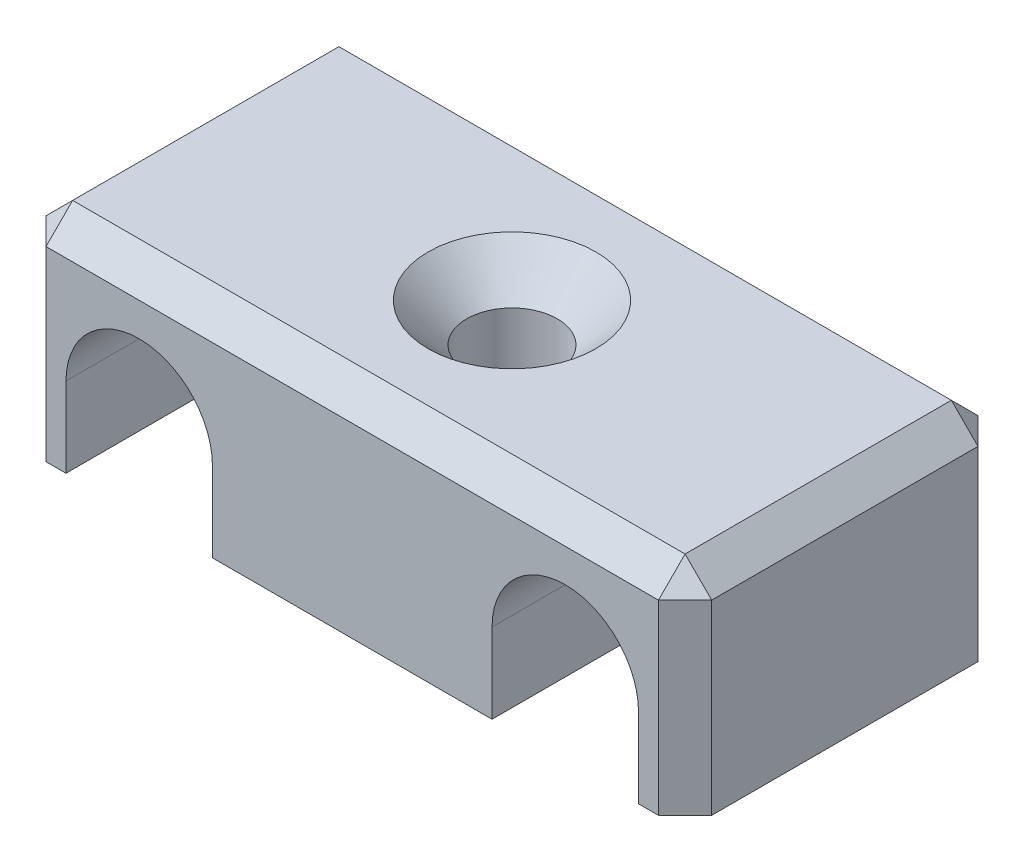
ISO-10303-21;
HEADER;
FILE_DESCRIPTION(('STEP AP214'),'2;1');
FILE_NAME('part.step','',(''),(''),'','','');
FILE_SCHEMA(('AUTOMOTIVE_DESIGN { 1 0 10303 214 1 1 1 1 }'));
ENDSEC;
DATA;
#1=APPLICATION_CONTEXT('core data for automotive mechanical design processes');
#2=APPLICATION_PROTOCOL_DEFINITION('international standard','automotive_design',2000,#1);
#3=PRODUCT_CONTEXT('',#1,'mechanical');
#4=PRODUCT('Part','Part','',(#3));
#5=PRODUCT_RELATED_PRODUCT_CATEGORY('part','',(#4));
#6=PRODUCT_DEFINITION_FORMATION('','',#4);
#7=PRODUCT_DEFINITION_CONTEXT('part definition',#1,'design');
#8=PRODUCT_DEFINITION('design','',#6,#7);
#9=PRODUCT_DEFINITION_SHAPE('','',#8);
#10=(LENGTH_UNIT() NAMED_UNIT(*) SI_UNIT(.MILLI.,.METRE.));
#11=(NAMED_UNIT(*) PLANE_ANGLE_UNIT() SI_UNIT($,.RADIAN.));
#12=(NAMED_UNIT(*) SI_UNIT($,.STERADIAN.) SOLID_ANGLE_UNIT());
#13=UNCERTAINTY_MEASURE_WITH_UNIT(LENGTH_MEASURE(1.E-05),#10,'distance_accuracy_value','');
#14=(GEOMETRIC_REPRESENTATION_CONTEXT(3) GLOBAL_UNCERTAINTY_ASSIGNED_CONTEXT((#13)) GLOBAL_UNIT_ASSIGNED_CONTEXT((#10,
#11,#12)) REPRESENTATION_CONTEXT('',''));
#15=CARTESIAN_POINT('',(0.,0.,0.));
#16=DIRECTION('',(0.,0.,1.));
#17=DIRECTION('',(1.,0.,0.));
#18=AXIS2_PLACEMENT_3D('',#15,#16,#17);
#19=CARTESIAN_POINT('',(-12.5,-4.,12.));
#20=DIRECTION('',(0.,1.,0.));
#21=DIRECTION('',(0.,0.,1.));
#22=AXIS2_PLACEMENT_3D('',#19,#20,#21);
#23=PLANE('',#22);
#24=DIRECTION('',(1.,0.,0.));
#25=VECTOR('',#24,1.);
#26=CARTESIAN_POINT('',(-12.5,-4.,0.));
#27=LINE('',#26,#25);
#28=CARTESIAN_POINT('',(10.75,-4.,0.));
#29=VERTEX_POINT('',#28);
#30=CARTESIAN_POINT('',(11.5,-4.,0.));
#31=VERTEX_POINT('',#30);
#32=EDGE_CURVE('E238',#29,#31,#27,.T.);
#33=ORIENTED_EDGE('',*,*,#32,.T.);
#34=DIRECTION('',(0.70710678118655,0.,0.707106781186545));
#35=VECTOR('',#34,1.);
#36=CARTESIAN_POINT('',(12.5,-4.,0.999999999999997));
#37=LINE('',#36,#35);
#38=CARTESIAN_POINT('',(12.5,-4.,0.999999999999997));
#39=VERTEX_POINT('',#38);
#40=EDGE_CURVE('E286',#31,#39,#37,.T.);
#41=ORIENTED_EDGE('',*,*,#40,.T.);
#42=DIRECTION('',(0.,0.,-1.));
#43=VECTOR('',#42,1.);
#44=CARTESIAN_POINT('',(12.5,-4.,12.));
#45=LINE('',#44,#43);
#46=CARTESIAN_POINT('',(12.5,-4.,11.));
#47=VERTEX_POINT('',#46);
#48=EDGE_CURVE('E241',#47,#39,#45,.T.);
#49=ORIENTED_EDGE('',*,*,#48,.F.);
#50=DIRECTION('',(0.707106781186545,0.,-0.70710678118655));
#51=VECTOR('',#50,1.);
#52=CARTESIAN_POINT('',(11.5,-4.,12.));
#53=LINE('',#52,#51);
#54=CARTESIAN_POINT('',(11.5,-4.,12.));
#55=VERTEX_POINT('',#54);
#56=EDGE_CURVE('E284',#47,#55,#53,.F.);
#57=ORIENTED_EDGE('',*,*,#56,.T.);
#58=DIRECTION('',(1.,0.,0.));
#59=VECTOR('',#58,1.);
#60=CARTESIAN_POINT('',(-12.5,-4.,12.));
#61=LINE('',#60,#59);
#62=CARTESIAN_POINT('',(10.75,-4.,12.));
#63=VERTEX_POINT('',#62);
#64=EDGE_CURVE('E243',#63,#55,#61,.T.);
#65=ORIENTED_EDGE('',*,*,#64,.F.);
#66=DIRECTION('',(0.,0.,1.));
#67=VECTOR('',#66,1.);
#68=CARTESIAN_POINT('',(10.75,-4.,0.));
#69=LINE('',#68,#67);
#70=EDGE_CURVE('E201',#29,#63,#69,.T.);
#71=ORIENTED_EDGE('',*,*,#70,.F.);
#72=EDGE_LOOP('',(#33,#41,#49,#57,#65,#71));
#73=FACE_BOUND('',#72,.T.);
#74=ADVANCED_FACE('F39',(#73),#23,.F.);
#75=CARTESIAN_POINT('',(0.,-4.,6.));
#76=DIRECTION('',(0.,1.,0.));
#77=DIRECTION('',(0.,0.,1.));
#78=AXIS2_PLACEMENT_3D('',#75,#76,#77);
#79=CIRCLE('',#78,1.7);
#80=CARTESIAN_POINT('',(0.,-4.,7.7));
#81=VERTEX_POINT('',#80);
#82=EDGE_CURVE('E235',#81,#81,#79,.T.);
#83=ORIENTED_EDGE('',*,*,#82,.T.);
#84=EDGE_LOOP('',(#83));
#85=FACE_BOUND('',#84,.T.);
#86=CARTESIAN_POINT('',(-5.25,-4.,0.));
#87=VERTEX_POINT('',#86);
#88=CARTESIAN_POINT('',(5.25,-4.,0.));
#89=VERTEX_POINT('',#88);
#90=EDGE_CURVE('E246',#87,#89,#27,.T.);
#91=ORIENTED_EDGE('',*,*,#90,.T.);
#92=DIRECTION('',(0.,0.,1.));
#93=VECTOR('',#92,1.);
#94=CARTESIAN_POINT('',(5.25,-4.,0.));
#95=LINE('',#94,#93);
#96=CARTESIAN_POINT('',(5.25,-4.,12.));
#97=VERTEX_POINT('',#96);
#98=EDGE_CURVE('E174',#89,#97,#95,.T.);
#99=ORIENTED_EDGE('',*,*,#98,.T.);
#100=CARTESIAN_POINT('',(-5.25,-4.,12.));
#101=VERTEX_POINT('',#100);
#102=EDGE_CURVE('E242',#101,#97,#61,.T.);
#103=ORIENTED_EDGE('',*,*,#102,.F.);
#104=DIRECTION('',(0.,0.,1.));
#105=VECTOR('',#104,1.);
#106=CARTESIAN_POINT('',(-5.25,-4.,0.));
#107=LINE('',#106,#105);
#108=EDGE_CURVE('E210',#87,#101,#107,.T.);
#109=ORIENTED_EDGE('',*,*,#108,.F.);
#110=EDGE_LOOP('',(#91,#99,#103,#109));
#111=FACE_BOUND('',#110,.T.);
#112=ADVANCED_FACE('F362',(#85,#111),#23,.F.);
#113=CARTESIAN_POINT('',(12.5,-4.,12.));
#114=DIRECTION('',(-1.,0.,0.));
#115=DIRECTION('',(0.,0.,1.));
#116=AXIS2_PLACEMENT_3D('',#113,#114,#115);
#117=PLANE('',#116);
#118=ORIENTED_EDGE('',*,*,#48,.T.);
#119=DIRECTION('',(0.,1.,0.));
#120=VECTOR('',#119,1.);
#121=CARTESIAN_POINT('',(12.5,4.,0.999999999999997));
#122=LINE('',#121,#120);
#123=CARTESIAN_POINT('',(12.5,3.,0.999999999999997));
#124=VERTEX_POINT('',#123);
#125=EDGE_CURVE('E282',#39,#124,#122,.T.);
#126=ORIENTED_EDGE('',*,*,#125,.T.);
#127=DIRECTION('',(0.,0.,1.));
#128=VECTOR('',#127,1.);
#129=CARTESIAN_POINT('',(12.5,3.,12.));
#130=LINE('',#129,#128);
#131=CARTESIAN_POINT('',(12.5,3.,11.));
#132=VERTEX_POINT('',#131);
#133=EDGE_CURVE('E280',#124,#132,#130,.T.);
#134=ORIENTED_EDGE('',*,*,#133,.T.);
#135=DIRECTION('',(0.,-1.,0.));
#136=VECTOR('',#135,1.);
#137=CARTESIAN_POINT('',(12.5,-4.,11.));
#138=LINE('',#137,#136);
#139=EDGE_CURVE('E278',#132,#47,#138,.T.);
#140=ORIENTED_EDGE('',*,*,#139,.T.);
#141=EDGE_LOOP('',(#118,#126,#134,#140));
#142=FACE_BOUND('',#141,.T.);
#143=ADVANCED_FACE('F372',(#142),#117,.F.);
#144=CARTESIAN_POINT('',(-12.5,4.,12.));
#145=DIRECTION('',(0.,-1.,0.));
#146=DIRECTION('',(0.,0.,-1.));
#147=AXIS2_PLACEMENT_3D('',#144,#145,#146);
#148=PLANE('',#147);
#149=DIRECTION('',(-1.,0.,0.));
#150=VECTOR('',#149,1.);
#151=CARTESIAN_POINT('',(-12.5,4.,0.999999999999997));
#152=LINE('',#151,#150);
#153=CARTESIAN_POINT('',(11.5,4.,0.999999999999997));
#154=VERTEX_POINT('',#153);
#155=CARTESIAN_POINT('',(-11.5,4.,0.999999999999997));
#156=VERTEX_POINT('',#155);
#157=EDGE_CURVE('E263',#154,#156,#152,.T.);
#158=ORIENTED_EDGE('',*,*,#157,.T.);
#159=DIRECTION('',(0.,0.,1.));
#160=VECTOR('',#159,1.);
#161=CARTESIAN_POINT('',(-11.5,4.,12.));
#162=LINE('',#161,#160);
#163=CARTESIAN_POINT('',(-11.5,4.,11.));
#164=VERTEX_POINT('',#163);
#165=EDGE_CURVE('E265',#156,#164,#162,.T.);
#166=ORIENTED_EDGE('',*,*,#165,.T.);
#167=DIRECTION('',(1.,0.,0.));
#168=VECTOR('',#167,1.);
#169=CARTESIAN_POINT('',(-12.5,4.,11.));
#170=LINE('',#169,#168);
#171=CARTESIAN_POINT('',(11.5,4.,11.));
#172=VERTEX_POINT('',#171);
#173=EDGE_CURVE('E259',#164,#172,#170,.T.);
#174=ORIENTED_EDGE('',*,*,#173,.T.);
#175=DIRECTION('',(0.,0.,-1.));
#176=VECTOR('',#175,1.);
#177=CARTESIAN_POINT('',(11.5,4.,12.));
#178=LINE('',#177,#176);
#179=EDGE_CURVE('E261',#172,#154,#178,.T.);
#180=ORIENTED_EDGE('',*,*,#179,.T.);
#181=EDGE_LOOP('',(#158,#166,#174,#180));
#182=FACE_BOUND('',#181,.T.);
#183=CARTESIAN_POINT('',(0.,4.,6.));
#184=DIRECTION('',(0.,1.,0.));
#185=DIRECTION('',(0.,0.,1.));
#186=AXIS2_PLACEMENT_3D('',#183,#184,#185);
#187=CIRCLE('',#186,3.15);
#188=CARTESIAN_POINT('',(0.,4.,9.15));
#189=VERTEX_POINT('',#188);
#190=EDGE_CURVE('E200',#189,#189,#187,.T.);
#191=ORIENTED_EDGE('',*,*,#190,.F.);
#192=EDGE_LOOP('',(#191));
#193=FACE_BOUND('',#192,.T.);
#194=ADVANCED_FACE('F392',(#182,#193),#148,.F.);
#195=CARTESIAN_POINT('',(-12.5,-4.,12.));
#196=DIRECTION('',(1.,0.,0.));
#197=DIRECTION('',(0.,0.,-1.));
#198=AXIS2_PLACEMENT_3D('',#195,#196,#197);
#199=PLANE('',#198);
#200=DIRECTION('',(0.,0.,-1.));
#201=VECTOR('',#200,1.);
#202=CARTESIAN_POINT('',(-12.5,3.,12.));
#203=LINE('',#202,#201);
#204=CARTESIAN_POINT('',(-12.5,3.,11.));
#205=VERTEX_POINT('',#204);
#206=CARTESIAN_POINT('',(-12.5,3.,1.));
#207=VERTEX_POINT('',#206);
#208=EDGE_CURVE('E254',#205,#207,#203,.T.);
#209=ORIENTED_EDGE('',*,*,#208,.T.);
#210=DIRECTION('',(0.,-1.,0.));
#211=VECTOR('',#210,1.);
#212=CARTESIAN_POINT('',(-12.5,-4.,1.));
#213=LINE('',#212,#211);
#214=CARTESIAN_POINT('',(-12.5,-4.,1.));
#215=VERTEX_POINT('',#214);
#216=EDGE_CURVE('E257',#207,#215,#213,.T.);
#217=ORIENTED_EDGE('',*,*,#216,.T.);
#218=DIRECTION('',(0.,0.,-1.));
#219=VECTOR('',#218,1.);
#220=CARTESIAN_POINT('',(-12.5,-4.,12.));
#221=LINE('',#220,#219);
#222=CARTESIAN_POINT('',(-12.5,-4.,11.));
#223=VERTEX_POINT('',#222);
#224=EDGE_CURVE('E249',#223,#215,#221,.T.);
#225=ORIENTED_EDGE('',*,*,#224,.F.);
#226=DIRECTION('',(0.,1.,0.));
#227=VECTOR('',#226,1.);
#228=CARTESIAN_POINT('',(-12.5,-4.,11.));
#229=LINE('',#228,#227);
#230=EDGE_CURVE('E252',#223,#205,#229,.T.);
#231=ORIENTED_EDGE('',*,*,#230,.T.);
#232=EDGE_LOOP('',(#209,#217,#225,#231));
#233=FACE_BOUND('',#232,.T.);
#234=ADVANCED_FACE('F405',(#233),#199,.F.);
#235=ORIENTED_EDGE('',*,*,#224,.T.);
#236=DIRECTION('',(0.707106781186545,0.,-0.70710678118655));
#237=VECTOR('',#236,1.);
#238=CARTESIAN_POINT('',(-12.5,-4.,1.));
#239=LINE('',#238,#237);
#240=CARTESIAN_POINT('',(-11.5,-4.,0.));
#241=VERTEX_POINT('',#240);
#242=EDGE_CURVE('E270',#215,#241,#239,.T.);
#243=ORIENTED_EDGE('',*,*,#242,.T.);
#244=CARTESIAN_POINT('',(-10.75,-4.,0.));
#245=VERTEX_POINT('',#244);
#246=EDGE_CURVE('E244',#241,#245,#27,.T.);
#247=ORIENTED_EDGE('',*,*,#246,.T.);
#248=DIRECTION('',(0.,0.,1.));
#249=VECTOR('',#248,1.);
#250=CARTESIAN_POINT('',(-10.75,-4.,0.));
#251=LINE('',#250,#249);
#252=CARTESIAN_POINT('',(-10.75,-4.,12.));
#253=VERTEX_POINT('',#252);
#254=EDGE_CURVE('E207',#245,#253,#251,.T.);
#255=ORIENTED_EDGE('',*,*,#254,.T.);
#256=CARTESIAN_POINT('',(-11.5,-4.,12.));
#257=VERTEX_POINT('',#256);
#258=EDGE_CURVE('E239',#257,#253,#61,.T.);
#259=ORIENTED_EDGE('',*,*,#258,.F.);
#260=DIRECTION('',(0.707106781186545,0.,0.70710678118655));
#261=VECTOR('',#260,1.);
#262=CARTESIAN_POINT('',(-11.5,-4.,12.));
#263=LINE('',#262,#261);
#264=EDGE_CURVE('E268',#257,#223,#263,.F.);
#265=ORIENTED_EDGE('',*,*,#264,.T.);
#266=EDGE_LOOP('',(#235,#243,#247,#255,#259,#265));
#267=FACE_BOUND('',#266,.T.);
#268=ADVANCED_FACE('F345',(#267),#23,.F.);
#269=CARTESIAN_POINT('',(0.,0.,12.));
#270=DIRECTION('',(0.,0.,-1.));
#271=DIRECTION('',(-1.,0.,0.));
#272=AXIS2_PLACEMENT_3D('',#269,#270,#271);
#273=PLANE('',#272);
#274=ORIENTED_EDGE('',*,*,#64,.T.);
#275=DIRECTION('',(0.,1.,0.));
#276=VECTOR('',#275,1.);
#277=CARTESIAN_POINT('',(11.5,0.,12.));
#278=LINE('',#277,#276);
#279=CARTESIAN_POINT('',(11.5,3.,12.));
#280=VERTEX_POINT('',#279);
#281=EDGE_CURVE('E11',#55,#280,#278,.T.);
#282=ORIENTED_EDGE('',*,*,#281,.T.);
#283=DIRECTION('',(-1.,0.,0.));
#284=VECTOR('',#283,1.);
#285=CARTESIAN_POINT('',(0.,3.,12.));
#286=LINE('',#285,#284);
#287=CARTESIAN_POINT('',(-11.5,3.,12.));
#288=VERTEX_POINT('',#287);
#289=EDGE_CURVE('E49',#280,#288,#286,.T.);
#290=ORIENTED_EDGE('',*,*,#289,.T.);
#291=DIRECTION('',(0.,-1.,0.));
#292=VECTOR('',#291,1.);
#293=CARTESIAN_POINT('',(-11.5,0.,12.));
#294=LINE('',#293,#292);
#295=EDGE_CURVE('E288',#288,#257,#294,.T.);
#296=ORIENTED_EDGE('',*,*,#295,.T.);
#297=ORIENTED_EDGE('',*,*,#258,.T.);
#298=DIRECTION('',(0.,-1.,0.));
#299=VECTOR('',#298,1.);
#300=CARTESIAN_POINT('',(-10.75,-1.,12.));
#301=LINE('',#300,#299);
#302=CARTESIAN_POINT('',(-10.75,-1.,12.));
#303=VERTEX_POINT('',#302);
#304=EDGE_CURVE('E217',#303,#253,#301,.T.);
#305=ORIENTED_EDGE('',*,*,#304,.F.);
#306=CARTESIAN_POINT('',(-8.,-1.,12.));
#307=DIRECTION('',(0.,0.,1.));
#308=DIRECTION('',(1.,0.,0.));
#309=AXIS2_PLACEMENT_3D('',#306,#307,#308);
#310=CIRCLE('',#309,2.75);
#311=CARTESIAN_POINT('',(-5.25,-1.,12.));
#312=VERTEX_POINT('',#311);
#313=EDGE_CURVE('E196',#312,#303,#310,.T.);
#314=ORIENTED_EDGE('',*,*,#313,.F.);
#315=DIRECTION('',(0.,1.,0.));
#316=VECTOR('',#315,1.);
#317=CARTESIAN_POINT('',(-5.25,-1.,12.));
#318=LINE('',#317,#316);
#319=EDGE_CURVE('E214',#101,#312,#318,.T.);
#320=ORIENTED_EDGE('',*,*,#319,.F.);
#321=ORIENTED_EDGE('',*,*,#102,.T.);
#322=DIRECTION('',(0.,-1.,0.));
#323=VECTOR('',#322,1.);
#324=CARTESIAN_POINT('',(5.25,-1.,12.));
#325=LINE('',#324,#323);
#326=CARTESIAN_POINT('',(5.25,-1.,12.));
#327=VERTEX_POINT('',#326);
#328=EDGE_CURVE('E191',#327,#97,#325,.T.);
#329=ORIENTED_EDGE('',*,*,#328,.F.);
#330=CARTESIAN_POINT('',(8.,-1.,12.));
#331=DIRECTION('',(0.,0.,1.));
#332=DIRECTION('',(1.,0.,0.));
#333=AXIS2_PLACEMENT_3D('',#330,#331,#332);
#334=CIRCLE('',#333,2.75);
#335=CARTESIAN_POINT('',(10.75,-1.,12.));
#336=VERTEX_POINT('',#335);
#337=EDGE_CURVE('E171',#336,#327,#334,.T.);
#338=ORIENTED_EDGE('',*,*,#337,.F.);
#339=DIRECTION('',(0.,1.,0.));
#340=VECTOR('',#339,1.);
#341=CARTESIAN_POINT('',(10.75,-1.,12.));
#342=LINE('',#341,#340);
#343=EDGE_CURVE('E188',#63,#336,#342,.T.);
#344=ORIENTED_EDGE('',*,*,#343,.F.);
#345=EDGE_LOOP('',(#274,#282,#290,#296,#297,#305,#314,#320,#321,#329,#338,#344));
#346=FACE_BOUND('',#345,.T.);
#347=ADVANCED_FACE('F342',(#346),#273,.F.);
#348=CARTESIAN_POINT('',(0.,0.,0.));
#349=DIRECTION('',(0.,0.,-1.));
#350=DIRECTION('',(-1.,0.,0.));
#351=AXIS2_PLACEMENT_3D('',#348,#349,#350);
#352=PLANE('',#351);
#353=ORIENTED_EDGE('',*,*,#246,.F.);
#354=DIRECTION('',(0.,1.,0.));
#355=VECTOR('',#354,1.);
#356=CARTESIAN_POINT('',(-11.5,4.,0.));
#357=LINE('',#356,#355);
#358=CARTESIAN_POINT('',(-11.5,3.,0.));
#359=VERTEX_POINT('',#358);
#360=EDGE_CURVE('E276',#241,#359,#357,.T.);
#361=ORIENTED_EDGE('',*,*,#360,.T.);
#362=DIRECTION('',(1.,0.,0.));
#363=VECTOR('',#362,1.);
#364=CARTESIAN_POINT('',(12.5,3.,0.));
#365=LINE('',#364,#363);
#366=CARTESIAN_POINT('',(11.5,3.,0.));
#367=VERTEX_POINT('',#366);
#368=EDGE_CURVE('E274',#359,#367,#365,.T.);
#369=ORIENTED_EDGE('',*,*,#368,.T.);
#370=DIRECTION('',(0.,-1.,0.));
#371=VECTOR('',#370,1.);
#372=CARTESIAN_POINT('',(11.5,-4.,0.));
#373=LINE('',#372,#371);
#374=EDGE_CURVE('E272',#367,#31,#373,.T.);
#375=ORIENTED_EDGE('',*,*,#374,.T.);
#376=ORIENTED_EDGE('',*,*,#32,.F.);
#377=DIRECTION('',(0.,1.,0.));
#378=VECTOR('',#377,1.);
#379=CARTESIAN_POINT('',(10.75,-1.,0.));
#380=LINE('',#379,#378);
#381=CARTESIAN_POINT('',(10.75,-1.,0.));
#382=VERTEX_POINT('',#381);
#383=EDGE_CURVE('E175',#29,#382,#380,.T.);
#384=ORIENTED_EDGE('',*,*,#383,.T.);
#385=CARTESIAN_POINT('',(8.,-1.,0.));
#386=DIRECTION('',(0.,0.,1.));
#387=DIRECTION('',(1.,0.,0.));
#388=AXIS2_PLACEMENT_3D('',#385,#386,#387);
#389=CIRCLE('',#388,2.75);
#390=CARTESIAN_POINT('',(5.25,-1.,0.));
#391=VERTEX_POINT('',#390);
#392=EDGE_CURVE('E168',#382,#391,#389,.T.);
#393=ORIENTED_EDGE('',*,*,#392,.T.);
#394=DIRECTION('',(0.,-1.,0.));
#395=VECTOR('',#394,1.);
#396=CARTESIAN_POINT('',(5.25,-1.,0.));
#397=LINE('',#396,#395);
#398=EDGE_CURVE('E178',#391,#89,#397,.T.);
#399=ORIENTED_EDGE('',*,*,#398,.T.);
#400=ORIENTED_EDGE('',*,*,#90,.F.);
#401=DIRECTION('',(0.,1.,0.));
#402=VECTOR('',#401,1.);
#403=CARTESIAN_POINT('',(-5.25,-1.,0.));
#404=LINE('',#403,#402);
#405=CARTESIAN_POINT('',(-5.25,-1.,0.));
#406=VERTEX_POINT('',#405);
#407=EDGE_CURVE('E206',#87,#406,#404,.T.);
#408=ORIENTED_EDGE('',*,*,#407,.T.);
#409=CARTESIAN_POINT('',(-8.,-1.,0.));
#410=DIRECTION('',(0.,0.,1.));
#411=DIRECTION('',(1.,0.,0.));
#412=AXIS2_PLACEMENT_3D('',#409,#410,#411);
#413=CIRCLE('',#412,2.75);
#414=CARTESIAN_POINT('',(-10.75,-1.,0.));
#415=VERTEX_POINT('',#414);
#416=EDGE_CURVE('E218',#406,#415,#413,.T.);
#417=ORIENTED_EDGE('',*,*,#416,.T.);
#418=DIRECTION('',(0.,-1.,0.));
#419=VECTOR('',#418,1.);
#420=CARTESIAN_POINT('',(-10.75,-1.,0.));
#421=LINE('',#420,#419);
#422=EDGE_CURVE('E225',#415,#245,#421,.T.);
#423=ORIENTED_EDGE('',*,*,#422,.T.);
#424=EDGE_LOOP('',(#353,#361,#369,#375,#376,#384,#393,#399,#400,#408,#417,#423));
#425=FACE_BOUND('',#424,.T.);
#426=ADVANCED_FACE('F186',(#425),#352,.T.);
#427=CARTESIAN_POINT('',(0.,4.,6.));
#428=DIRECTION('',(0.,1.,0.));
#429=DIRECTION('',(0.,0.,1.));
#430=AXIS2_PLACEMENT_3D('',#427,#428,#429);
#431=CYLINDRICAL_SURFACE('',#430,1.69999999999999);
#432=ORIENTED_EDGE('',*,*,#82,.F.);
#433=EDGE_LOOP('',(#432));
#434=FACE_BOUND('',#433,.T.);
#435=CARTESIAN_POINT('',(0.,2.54999999999999,6.));
#436=DIRECTION('',(0.,1.,0.));
#437=DIRECTION('',(0.,0.,1.));
#438=AXIS2_PLACEMENT_3D('',#435,#436,#437);
#439=CIRCLE('',#438,1.69999999999999);
#440=CARTESIAN_POINT('',(0.,2.54999999999999,7.69999999999999));
#441=VERTEX_POINT('',#440);
#442=EDGE_CURVE('E232',#441,#441,#439,.T.);
#443=ORIENTED_EDGE('',*,*,#442,.T.);
#444=EDGE_LOOP('',(#443));
#445=FACE_BOUND('',#444,.T.);
#446=ADVANCED_FACE('F422',(#434,#445),#431,.F.);
#447=CARTESIAN_POINT('',(0.,4.,6.));
#448=DIRECTION('',(0.,1.,0.));
#449=DIRECTION('',(0.,0.,1.));
#450=AXIS2_PLACEMENT_3D('',#447,#448,#449);
#451=CONICAL_SURFACE('',#450,3.15,0.78539816339745);
#452=ORIENTED_EDGE('',*,*,#442,.F.);
#453=EDGE_LOOP('',(#452));
#454=FACE_BOUND('',#453,.T.);
#455=ORIENTED_EDGE('',*,*,#190,.T.);
#456=EDGE_LOOP('',(#455));
#457=FACE_BOUND('',#456,.T.);
#458=ADVANCED_FACE('F427',(#454,#457),#451,.F.);
#459=CARTESIAN_POINT('',(-8.,-1.,0.));
#460=DIRECTION('',(0.,0.,1.));
#461=DIRECTION('',(1.,0.,0.));
#462=AXIS2_PLACEMENT_3D('',#459,#460,#461);
#463=CYLINDRICAL_SURFACE('',#462,2.75);
#464=ORIENTED_EDGE('',*,*,#313,.T.);
#465=DIRECTION('',(0.,0.,1.));
#466=VECTOR('',#465,1.);
#467=CARTESIAN_POINT('',(-10.75,-1.,0.));
#468=LINE('',#467,#466);
#469=EDGE_CURVE('E204',#415,#303,#468,.T.);
#470=ORIENTED_EDGE('',*,*,#469,.F.);
#471=ORIENTED_EDGE('',*,*,#416,.F.);
#472=DIRECTION('',(0.,0.,1.));
#473=VECTOR('',#472,1.);
#474=CARTESIAN_POINT('',(-5.25,-1.,0.));
#475=LINE('',#474,#473);
#476=EDGE_CURVE('E212',#406,#312,#475,.T.);
#477=ORIENTED_EDGE('',*,*,#476,.T.);
#478=EDGE_LOOP('',(#464,#470,#471,#477));
#479=FACE_BOUND('',#478,.T.);
#480=ADVANCED_FACE('F354',(#479),#463,.F.);
#481=CARTESIAN_POINT('',(-5.25,-1.,0.));
#482=DIRECTION('',(1.,0.,0.));
#483=DIRECTION('',(0.,0.,-1.));
#484=AXIS2_PLACEMENT_3D('',#481,#482,#483);
#485=PLANE('',#484);
#486=ORIENTED_EDGE('',*,*,#319,.T.);
#487=ORIENTED_EDGE('',*,*,#476,.F.);
#488=ORIENTED_EDGE('',*,*,#407,.F.);
#489=ORIENTED_EDGE('',*,*,#108,.T.);
#490=EDGE_LOOP('',(#486,#487,#488,#489));
#491=FACE_BOUND('',#490,.T.);
#492=ADVANCED_FACE('F432',(#491),#485,.F.);
#493=CARTESIAN_POINT('',(-10.75,-1.,0.));
#494=DIRECTION('',(-1.,0.,0.));
#495=DIRECTION('',(0.,0.,1.));
#496=AXIS2_PLACEMENT_3D('',#493,#494,#495);
#497=PLANE('',#496);
#498=ORIENTED_EDGE('',*,*,#304,.T.);
#499=ORIENTED_EDGE('',*,*,#254,.F.);
#500=ORIENTED_EDGE('',*,*,#422,.F.);
#501=ORIENTED_EDGE('',*,*,#469,.T.);
#502=EDGE_LOOP('',(#498,#499,#500,#501));
#503=FACE_BOUND('',#502,.T.);
#504=ADVANCED_FACE('F350',(#503),#497,.F.);
#505=CARTESIAN_POINT('',(8.,-1.,0.));
#506=DIRECTION('',(0.,0.,1.));
#507=DIRECTION('',(1.,0.,0.));
#508=AXIS2_PLACEMENT_3D('',#505,#506,#507);
#509=CYLINDRICAL_SURFACE('',#508,2.75);
#510=ORIENTED_EDGE('',*,*,#337,.T.);
#511=DIRECTION('',(0.,0.,1.));
#512=VECTOR('',#511,1.);
#513=CARTESIAN_POINT('',(5.25,-1.,0.));
#514=LINE('',#513,#512);
#515=EDGE_CURVE('E164',#391,#327,#514,.T.);
#516=ORIENTED_EDGE('',*,*,#515,.F.);
#517=ORIENTED_EDGE('',*,*,#392,.F.);
#518=DIRECTION('',(0.,0.,1.));
#519=VECTOR('',#518,1.);
#520=CARTESIAN_POINT('',(10.75,-1.,0.));
#521=LINE('',#520,#519);
#522=EDGE_CURVE('E198',#382,#336,#521,.T.);
#523=ORIENTED_EDGE('',*,*,#522,.T.);
#524=EDGE_LOOP('',(#510,#516,#517,#523));
#525=FACE_BOUND('',#524,.T.);
#526=ADVANCED_FACE('F166',(#525),#509,.F.);
#527=CARTESIAN_POINT('',(10.75,-1.,0.));
#528=DIRECTION('',(1.,0.,0.));
#529=DIRECTION('',(0.,0.,-1.));
#530=AXIS2_PLACEMENT_3D('',#527,#528,#529);
#531=PLANE('',#530);
#532=ORIENTED_EDGE('',*,*,#343,.T.);
#533=ORIENTED_EDGE('',*,*,#522,.F.);
#534=ORIENTED_EDGE('',*,*,#383,.F.);
#535=ORIENTED_EDGE('',*,*,#70,.T.);
#536=EDGE_LOOP('',(#532,#533,#534,#535));
#537=FACE_BOUND('',#536,.T.);
#538=ADVANCED_FACE('F441',(#537),#531,.F.);
#539=CARTESIAN_POINT('',(5.25,-1.,0.));
#540=DIRECTION('',(-1.,0.,0.));
#541=DIRECTION('',(0.,-1.,0.));
#542=AXIS2_PLACEMENT_3D('',#539,#540,#541);
#543=PLANE('',#542);
#544=ORIENTED_EDGE('',*,*,#328,.T.);
#545=ORIENTED_EDGE('',*,*,#98,.F.);
#546=ORIENTED_EDGE('',*,*,#398,.F.);
#547=ORIENTED_EDGE('',*,*,#515,.T.);
#548=EDGE_LOOP('',(#544,#545,#546,#547));
#549=FACE_BOUND('',#548,.T.);
#550=ADVANCED_FACE('F179',(#549),#543,.F.);
#551=CARTESIAN_POINT('',(11.5,0.,12.));
#552=DIRECTION('',(-0.70710678118655,0.,-0.707106781186545));
#553=DIRECTION('',(0.,1.,0.));
#554=AXIS2_PLACEMENT_3D('',#551,#552,#553);
#555=PLANE('',#554);
#556=ORIENTED_EDGE('',*,*,#56,.F.);
#557=ORIENTED_EDGE('',*,*,#139,.F.);
#558=DIRECTION('',(-0.707106781186545,0.,0.70710678118655));
#559=VECTOR('',#558,1.);
#560=CARTESIAN_POINT('',(12.5,3.,11.));
#561=LINE('',#560,#559);
#562=EDGE_CURVE('E318',#280,#132,#561,.F.);
#563=ORIENTED_EDGE('',*,*,#562,.F.);
#564=ORIENTED_EDGE('',*,*,#281,.F.);
#565=EDGE_LOOP('',(#556,#557,#563,#564));
#566=FACE_BOUND('',#565,.T.);
#567=ADVANCED_FACE('F42',(#566),#555,.F.);
#568=CARTESIAN_POINT('',(12.5,-4.,0.999999999999997));
#569=DIRECTION('',(0.707106781186545,0.,-0.70710678118655));
#570=DIRECTION('',(0.,-1.,0.));
#571=AXIS2_PLACEMENT_3D('',#568,#569,#570);
#572=PLANE('',#571);
#573=ORIENTED_EDGE('',*,*,#40,.F.);
#574=ORIENTED_EDGE('',*,*,#374,.F.);
#575=DIRECTION('',(-0.70710678118655,0.,-0.707106781186545));
#576=VECTOR('',#575,1.);
#577=CARTESIAN_POINT('',(11.5,3.,0.));
#578=LINE('',#577,#576);
#579=EDGE_CURVE('E316',#124,#367,#578,.T.);
#580=ORIENTED_EDGE('',*,*,#579,.F.);
#581=ORIENTED_EDGE('',*,*,#125,.F.);
#582=EDGE_LOOP('',(#573,#574,#580,#581));
#583=FACE_BOUND('',#582,.T.);
#584=ADVANCED_FACE('F378',(#583),#572,.T.);
#585=CARTESIAN_POINT('',(11.5,4.,12.));
#586=DIRECTION('',(-0.70710678118655,-0.707106781186545,0.));
#587=DIRECTION('',(0.,0.,-1.));
#588=AXIS2_PLACEMENT_3D('',#585,#586,#587);
#589=PLANE('',#588);
#590=DIRECTION('',(0.707106781186545,-0.70710678118655,0.));
#591=VECTOR('',#590,1.);
#592=CARTESIAN_POINT('',(12.5,3.,11.));
#593=LINE('',#592,#591);
#594=EDGE_CURVE('E44',#132,#172,#593,.F.);
#595=ORIENTED_EDGE('',*,*,#594,.F.);
#596=ORIENTED_EDGE('',*,*,#133,.F.);
#597=DIRECTION('',(-0.707106781186545,0.70710678118655,0.));
#598=VECTOR('',#597,1.);
#599=CARTESIAN_POINT('',(12.,3.5,0.999999999999997));
#600=LINE('',#599,#598);
#601=EDGE_CURVE('E313',#154,#124,#600,.F.);
#602=ORIENTED_EDGE('',*,*,#601,.F.);
#603=ORIENTED_EDGE('',*,*,#179,.F.);
#604=EDGE_LOOP('',(#595,#596,#602,#603));
#605=FACE_BOUND('',#604,.T.);
#606=ADVANCED_FACE('F381',(#605),#589,.F.);
#607=CARTESIAN_POINT('',(12.5,3.,11.));
#608=DIRECTION('',(0.57735026918963,0.577350269189626,0.577350269189622));
#609=DIRECTION('',(-0.707106781186545,0.70710678118655,0.));
#610=AXIS2_PLACEMENT_3D('',#607,#608,#609);
#611=PLANE('',#610);
#612=ORIENTED_EDGE('',*,*,#562,.T.);
#613=ORIENTED_EDGE('',*,*,#594,.T.);
#614=DIRECTION('',(0.,0.707106781186545,-0.70710678118655));
#615=VECTOR('',#614,1.);
#616=CARTESIAN_POINT('',(11.5,3.5,11.5));
#617=LINE('',#616,#615);
#618=EDGE_CURVE('E310',#280,#172,#617,.T.);
#619=ORIENTED_EDGE('',*,*,#618,.F.);
#620=EDGE_LOOP('',(#612,#613,#619));
#621=FACE_BOUND('',#620,.T.);
#622=ADVANCED_FACE('F324',(#621),#611,.T.);
#623=CARTESIAN_POINT('',(11.5,3.,0.));
#624=DIRECTION('',(0.577350269189626,0.577350269189622,-0.57735026918963));
#625=DIRECTION('',(-0.70710678118655,0.,-0.707106781186545));
#626=AXIS2_PLACEMENT_3D('',#623,#624,#625);
#627=PLANE('',#626);
#628=ORIENTED_EDGE('',*,*,#601,.T.);
#629=ORIENTED_EDGE('',*,*,#579,.T.);
#630=DIRECTION('',(0.,0.70710678118655,0.707106781186545));
#631=VECTOR('',#630,1.);
#632=CARTESIAN_POINT('',(11.5,3.,0.));
#633=LINE('',#632,#631);
#634=EDGE_CURVE('E307',#154,#367,#633,.F.);
#635=ORIENTED_EDGE('',*,*,#634,.F.);
#636=EDGE_LOOP('',(#628,#629,#635));
#637=FACE_BOUND('',#636,.T.);
#638=ADVANCED_FACE('F385',(#637),#627,.T.);
#639=CARTESIAN_POINT('',(0.,3.,12.));
#640=DIRECTION('',(0.,-0.70710678118655,-0.707106781186545));
#641=DIRECTION('',(-1.,0.,0.));
#642=AXIS2_PLACEMENT_3D('',#639,#640,#641);
#643=PLANE('',#642);
#644=ORIENTED_EDGE('',*,*,#618,.T.);
#645=ORIENTED_EDGE('',*,*,#173,.F.);
#646=DIRECTION('',(0.,-0.707106781186545,0.70710678118655));
#647=VECTOR('',#646,1.);
#648=CARTESIAN_POINT('',(-11.5,4.,11.));
#649=LINE('',#648,#647);
#650=EDGE_CURVE('E304',#288,#164,#649,.F.);
#651=ORIENTED_EDGE('',*,*,#650,.F.);
#652=ORIENTED_EDGE('',*,*,#289,.F.);
#653=EDGE_LOOP('',(#644,#645,#651,#652));
#654=FACE_BOUND('',#653,.T.);
#655=ADVANCED_FACE('F330',(#654),#643,.F.);
#656=CARTESIAN_POINT('',(-11.5,0.,12.));
#657=DIRECTION('',(0.70710678118655,0.,-0.707106781186545));
#658=DIRECTION('',(0.,-1.,0.));
#659=AXIS2_PLACEMENT_3D('',#656,#657,#658);
#660=PLANE('',#659);
#661=ORIENTED_EDGE('',*,*,#264,.F.);
#662=ORIENTED_EDGE('',*,*,#295,.F.);
#663=DIRECTION('',(-0.707106781186545,0.,-0.70710678118655));
#664=VECTOR('',#663,1.);
#665=CARTESIAN_POINT('',(-12.,3.,11.5));
#666=LINE('',#665,#664);
#667=EDGE_CURVE('E301',#205,#288,#666,.F.);
#668=ORIENTED_EDGE('',*,*,#667,.F.);
#669=ORIENTED_EDGE('',*,*,#230,.F.);
#670=EDGE_LOOP('',(#661,#662,#668,#669));
#671=FACE_BOUND('',#670,.T.);
#672=ADVANCED_FACE('F340',(#671),#660,.F.);
#673=CARTESIAN_POINT('',(-12.5,-4.,1.));
#674=DIRECTION('',(-0.70710678118655,0.,-0.707106781186545));
#675=DIRECTION('',(0.,1.,0.));
#676=AXIS2_PLACEMENT_3D('',#673,#674,#675);
#677=PLANE('',#676);
#678=ORIENTED_EDGE('',*,*,#242,.F.);
#679=ORIENTED_EDGE('',*,*,#216,.F.);
#680=DIRECTION('',(-0.707106781186545,0.,0.70710678118655));
#681=VECTOR('',#680,1.);
#682=CARTESIAN_POINT('',(-12.5,3.,1.));
#683=LINE('',#682,#681);
#684=EDGE_CURVE('E298',#359,#207,#683,.T.);
#685=ORIENTED_EDGE('',*,*,#684,.F.);
#686=ORIENTED_EDGE('',*,*,#360,.F.);
#687=EDGE_LOOP('',(#678,#679,#685,#686));
#688=FACE_BOUND('',#687,.T.);
#689=ADVANCED_FACE('F403',(#688),#677,.T.);
#690=CARTESIAN_POINT('',(-12.5,4.,0.999999999999997));
#691=DIRECTION('',(0.,0.707106781186545,-0.70710678118655));
#692=DIRECTION('',(1.,0.,0.));
#693=AXIS2_PLACEMENT_3D('',#690,#691,#692);
#694=PLANE('',#693);
#695=ORIENTED_EDGE('',*,*,#634,.T.);
#696=ORIENTED_EDGE('',*,*,#368,.F.);
#697=DIRECTION('',(0.,-0.70710678118655,-0.707106781186545));
#698=VECTOR('',#697,1.);
#699=CARTESIAN_POINT('',(-11.5,3.5,0.499999999999999));
#700=LINE('',#699,#698);
#701=EDGE_CURVE('E295',#156,#359,#700,.T.);
#702=ORIENTED_EDGE('',*,*,#701,.F.);
#703=ORIENTED_EDGE('',*,*,#157,.F.);
#704=EDGE_LOOP('',(#695,#696,#702,#703));
#705=FACE_BOUND('',#704,.T.);
#706=ADVANCED_FACE('F389',(#705),#694,.T.);
#707=CARTESIAN_POINT('',(-11.5,4.,11.));
#708=DIRECTION('',(-0.57735026918963,0.577350269189626,0.577350269189622));
#709=DIRECTION('',(-0.707106781186545,-0.70710678118655,0.));
#710=AXIS2_PLACEMENT_3D('',#707,#708,#709);
#711=PLANE('',#710);
#712=ORIENTED_EDGE('',*,*,#667,.T.);
#713=ORIENTED_EDGE('',*,*,#650,.T.);
#714=DIRECTION('',(0.707106781186545,0.70710678118655,0.));
#715=VECTOR('',#714,1.);
#716=CARTESIAN_POINT('',(-11.5,4.,11.));
#717=LINE('',#716,#715);
#718=EDGE_CURVE('E293',#205,#164,#717,.T.);
#719=ORIENTED_EDGE('',*,*,#718,.F.);
#720=EDGE_LOOP('',(#712,#713,#719));
#721=FACE_BOUND('',#720,.T.);
#722=ADVANCED_FACE('F335',(#721),#711,.T.);
#723=CARTESIAN_POINT('',(-12.5,3.,1.));
#724=DIRECTION('',(-0.57735026918963,0.577350269189622,-0.577350269189626));
#725=DIRECTION('',(-0.707106781186545,0.,0.70710678118655));
#726=AXIS2_PLACEMENT_3D('',#723,#724,#725);
#727=PLANE('',#726);
#728=ORIENTED_EDGE('',*,*,#701,.T.);
#729=ORIENTED_EDGE('',*,*,#684,.T.);
#730=DIRECTION('',(-0.707106781186545,-0.70710678118655,0.));
#731=VECTOR('',#730,1.);
#732=CARTESIAN_POINT('',(-12.5,3.,1.));
#733=LINE('',#732,#731);
#734=EDGE_CURVE('E291',#156,#207,#733,.T.);
#735=ORIENTED_EDGE('',*,*,#734,.F.);
#736=EDGE_LOOP('',(#728,#729,#735));
#737=FACE_BOUND('',#736,.T.);
#738=ADVANCED_FACE('F398',(#737),#727,.T.);
#739=CARTESIAN_POINT('',(-12.5,3.,12.));
#740=DIRECTION('',(0.70710678118655,-0.707106781186545,0.));
#741=DIRECTION('',(0.,0.,-1.));
#742=AXIS2_PLACEMENT_3D('',#739,#740,#741);
#743=PLANE('',#742);
#744=ORIENTED_EDGE('',*,*,#718,.T.);
#745=ORIENTED_EDGE('',*,*,#165,.F.);
#746=ORIENTED_EDGE('',*,*,#734,.T.);
#747=ORIENTED_EDGE('',*,*,#208,.F.);
#748=EDGE_LOOP('',(#744,#745,#746,#747));
#749=FACE_BOUND('',#748,.T.);
#750=ADVANCED_FACE('F396',(#749),#743,.F.);
#751=CLOSED_SHELL('',(#74,#112,#143,#194,#234,#268,#347,#426,#446,#458,#480,#492,#504,#526,#538,
#550,#567,#584,#606,#622,#638,#655,#672,#689,#706,#722,#738,#750));
#752=MANIFOLD_SOLID_BREP('B2',#751);
#753=ADVANCED_BREP_SHAPE_REPRESENTATION('',(#18,#752),#14);
#754=SHAPE_DEFINITION_REPRESENTATION(#9,#753);
ENDSEC;
END-ISO-10303-21;
